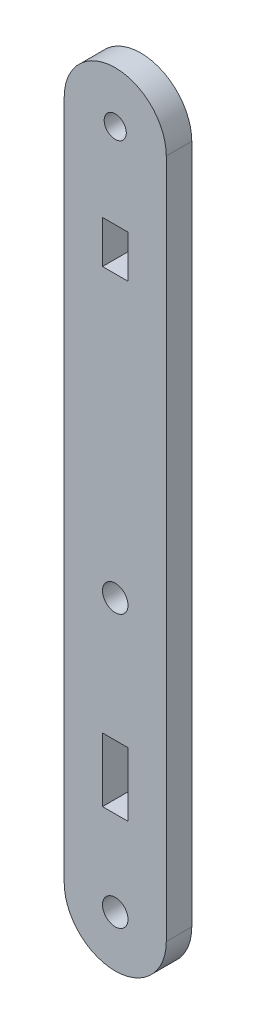
ISO-10303-21;
HEADER;
FILE_DESCRIPTION(('STEP AP214'),'2;1');
FILE_NAME('part.step','',(''),(''),'','','');
FILE_SCHEMA(('AUTOMOTIVE_DESIGN { 1 0 10303 214 1 1 1 1 }'));
ENDSEC;
DATA;
#1=APPLICATION_CONTEXT('core data for automotive mechanical design processes');
#2=APPLICATION_PROTOCOL_DEFINITION('international standard','automotive_design',2000,#1);
#3=PRODUCT_CONTEXT('',#1,'mechanical');
#4=PRODUCT('Part','Part','',(#3));
#5=PRODUCT_RELATED_PRODUCT_CATEGORY('part','',(#4));
#6=PRODUCT_DEFINITION_FORMATION('','',#4);
#7=PRODUCT_DEFINITION_CONTEXT('part definition',#1,'design');
#8=PRODUCT_DEFINITION('design','',#6,#7);
#9=PRODUCT_DEFINITION_SHAPE('','',#8);
#10=(LENGTH_UNIT() NAMED_UNIT(*) SI_UNIT(.MILLI.,.METRE.));
#11=(NAMED_UNIT(*) PLANE_ANGLE_UNIT() SI_UNIT($,.RADIAN.));
#12=(NAMED_UNIT(*) SI_UNIT($,.STERADIAN.) SOLID_ANGLE_UNIT());
#13=UNCERTAINTY_MEASURE_WITH_UNIT(LENGTH_MEASURE(1.E-05),#10,'distance_accuracy_value','');
#14=(GEOMETRIC_REPRESENTATION_CONTEXT(3) GLOBAL_UNCERTAINTY_ASSIGNED_CONTEXT((#13)) GLOBAL_UNIT_ASSIGNED_CONTEXT((#10,
#11,#12)) REPRESENTATION_CONTEXT('',''));
#15=CARTESIAN_POINT('',(0.,0.,0.));
#16=DIRECTION('',(0.,0.,1.));
#17=DIRECTION('',(1.,0.,0.));
#18=AXIS2_PLACEMENT_3D('',#15,#16,#17);
#19=CARTESIAN_POINT('',(42.3632,2.80600378878156,3.));
#20=DIRECTION('',(0.,0.,1.));
#21=DIRECTION('',(1.,0.,0.));
#22=AXIS2_PLACEMENT_3D('',#19,#20,#21);
#23=PLANE('',#22);
#24=CARTESIAN_POINT('',(42.3663580515541,2.81303551562959,3.));
#25=DIRECTION('',(0.,0.,1.));
#26=DIRECTION('',(1.,0.,0.));
#27=AXIS2_PLACEMENT_3D('',#24,#25,#26);
#28=CIRCLE('',#27,1.5);
#29=CARTESIAN_POINT('',(43.8663580515541,2.81303551562959,3.));
#30=VERTEX_POINT('',#29);
#31=EDGE_CURVE('E196',#30,#30,#28,.T.);
#32=ORIENTED_EDGE('',*,*,#31,.F.);
#33=EDGE_LOOP('',(#32));
#34=FACE_BOUND('',#33,.T.);
#35=CARTESIAN_POINT('',(42.3632,2.80600378878156,3.));
#36=DIRECTION('',(0.,0.,1.));
#37=DIRECTION('',(1.,0.,0.));
#38=AXIS2_PLACEMENT_3D('',#35,#36,#37);
#39=CIRCLE('',#38,6.00000000020829);
#40=CARTESIAN_POINT('',(36.3632000000001,2.80605378875133,3.));
#41=VERTEX_POINT('',#40);
#42=CARTESIAN_POINT('',(48.3632,2.80595378881178,3.));
#43=VERTEX_POINT('',#42);
#44=EDGE_CURVE('E208',#41,#43,#39,.T.);
#45=ORIENTED_EDGE('',*,*,#44,.T.);
#46=DIRECTION('',(0.,1.,0.));
#47=VECTOR('',#46,1.);
#48=CARTESIAN_POINT('',(48.3632,82.8060537888093,3.));
#49=LINE('',#48,#47);
#50=CARTESIAN_POINT('',(48.3632,82.8060537888093,3.));
#51=VERTEX_POINT('',#50);
#52=EDGE_CURVE('E211',#43,#51,#49,.T.);
#53=ORIENTED_EDGE('',*,*,#52,.T.);
#54=CARTESIAN_POINT('',(42.3631999999999,82.8060537888093,3.));
#55=DIRECTION('',(0.,0.,1.));
#56=DIRECTION('',(1.,0.,0.));
#57=AXIS2_PLACEMENT_3D('',#54,#55,#56);
#58=CIRCLE('',#57,6.);
#59=CARTESIAN_POINT('',(36.3632,82.8060537888093,3.));
#60=VERTEX_POINT('',#59);
#61=EDGE_CURVE('E214',#51,#60,#58,.T.);
#62=ORIENTED_EDGE('',*,*,#61,.T.);
#63=DIRECTION('',(0.,-1.,0.));
#64=VECTOR('',#63,1.);
#65=CARTESIAN_POINT('',(36.3632,82.8060537888093,3.));
#66=LINE('',#65,#64);
#67=EDGE_CURVE('E216',#60,#41,#66,.T.);
#68=ORIENTED_EDGE('',*,*,#67,.T.);
#69=EDGE_LOOP('',(#45,#53,#62,#68));
#70=FACE_BOUND('',#69,.T.);
#71=CARTESIAN_POINT('',(42.3632,34.8059537888087,3.));
#72=DIRECTION('',(0.,0.,1.));
#73=DIRECTION('',(1.,0.,0.));
#74=AXIS2_PLACEMENT_3D('',#71,#72,#73);
#75=CIRCLE('',#74,1.50000000000001);
#76=CARTESIAN_POINT('',(43.8632,34.8059537888087,3.));
#77=VERTEX_POINT('',#76);
#78=EDGE_CURVE('E202',#77,#77,#75,.T.);
#79=ORIENTED_EDGE('',*,*,#78,.F.);
#80=EDGE_LOOP('',(#79));
#81=FACE_BOUND('',#80,.T.);
#82=CARTESIAN_POINT('',(42.3631999999999,82.8060537888093,3.));
#83=DIRECTION('',(0.,0.,1.));
#84=DIRECTION('',(1.,0.,0.));
#85=AXIS2_PLACEMENT_3D('',#82,#83,#84);
#86=CIRCLE('',#85,1.29999999807684);
#87=CARTESIAN_POINT('',(43.6631999980768,82.8060537888093,3.));
#88=VERTEX_POINT('',#87);
#89=EDGE_CURVE('E190',#88,#88,#86,.T.);
#90=ORIENTED_EDGE('',*,*,#89,.F.);
#91=EDGE_LOOP('',(#90));
#92=FACE_BOUND('',#91,.T.);
#93=DIRECTION('',(-1.,0.,0.));
#94=VECTOR('',#93,1.);
#95=CARTESIAN_POINT('',(43.8632,72.8060537888094,3.));
#96=LINE('',#95,#94);
#97=CARTESIAN_POINT('',(43.8632,72.8060537888094,3.));
#98=VERTEX_POINT('',#97);
#99=CARTESIAN_POINT('',(40.8632,72.8060537888094,3.));
#100=VERTEX_POINT('',#99);
#101=EDGE_CURVE('E161',#98,#100,#96,.T.);
#102=ORIENTED_EDGE('',*,*,#101,.F.);
#103=DIRECTION('',(0.,1.,0.));
#104=VECTOR('',#103,1.);
#105=CARTESIAN_POINT('',(43.8632,67.8060537888094,3.));
#106=LINE('',#105,#104);
#107=CARTESIAN_POINT('',(43.8632,67.8060537888094,3.));
#108=VERTEX_POINT('',#107);
#109=EDGE_CURVE('E159',#108,#98,#106,.T.);
#110=ORIENTED_EDGE('',*,*,#109,.F.);
#111=DIRECTION('',(1.,0.,0.));
#112=VECTOR('',#111,1.);
#113=CARTESIAN_POINT('',(40.8632,67.8060537888094,3.));
#114=LINE('',#113,#112);
#115=CARTESIAN_POINT('',(40.8632,67.8060537888094,3.));
#116=VERTEX_POINT('',#115);
#117=EDGE_CURVE('E167',#116,#108,#114,.T.);
#118=ORIENTED_EDGE('',*,*,#117,.F.);
#119=DIRECTION('',(0.,-1.,0.));
#120=VECTOR('',#119,1.);
#121=CARTESIAN_POINT('',(40.8632,72.8060537888094,3.));
#122=LINE('',#121,#120);
#123=EDGE_CURVE('E164',#100,#116,#122,.T.);
#124=ORIENTED_EDGE('',*,*,#123,.F.);
#125=EDGE_LOOP('',(#102,#110,#118,#124));
#126=FACE_BOUND('',#125,.T.);
#127=DIRECTION('',(-1.,0.,0.));
#128=VECTOR('',#127,1.);
#129=CARTESIAN_POINT('',(43.8632,20.3060537888094,3.));
#130=LINE('',#129,#128);
#131=CARTESIAN_POINT('',(43.8632,20.3060537888094,3.));
#132=VERTEX_POINT('',#131);
#133=CARTESIAN_POINT('',(40.8632,20.3060537888094,3.));
#134=VERTEX_POINT('',#133);
#135=EDGE_CURVE('E131',#132,#134,#130,.T.);
#136=ORIENTED_EDGE('',*,*,#135,.F.);
#137=DIRECTION('',(0.,1.,0.));
#138=VECTOR('',#137,1.);
#139=CARTESIAN_POINT('',(43.8632,12.8060537888094,3.));
#140=LINE('',#139,#138);
#141=CARTESIAN_POINT('',(43.8632,12.8060537888094,3.));
#142=VERTEX_POINT('',#141);
#143=EDGE_CURVE('E123',#142,#132,#140,.T.);
#144=ORIENTED_EDGE('',*,*,#143,.F.);
#145=DIRECTION('',(1.,0.,0.));
#146=VECTOR('',#145,1.);
#147=CARTESIAN_POINT('',(40.8632,12.8060537888094,3.));
#148=LINE('',#147,#146);
#149=CARTESIAN_POINT('',(40.8632,12.8060537888094,3.));
#150=VERTEX_POINT('',#149);
#151=EDGE_CURVE('E145',#150,#142,#148,.T.);
#152=ORIENTED_EDGE('',*,*,#151,.F.);
#153=DIRECTION('',(0.,-1.,0.));
#154=VECTOR('',#153,1.);
#155=CARTESIAN_POINT('',(40.8632,20.3060537888094,3.));
#156=LINE('',#155,#154);
#157=EDGE_CURVE('E143',#134,#150,#156,.T.);
#158=ORIENTED_EDGE('',*,*,#157,.F.);
#159=EDGE_LOOP('',(#136,#144,#152,#158));
#160=FACE_BOUND('',#159,.T.);
#161=ADVANCED_FACE('F34',(#34,#70,#81,#92,#126,#160),#23,.T.);
#162=CARTESIAN_POINT('',(42.3632,2.80600378878156,0.));
#163=DIRECTION('',(0.,0.,1.));
#164=DIRECTION('',(1.,0.,0.));
#165=AXIS2_PLACEMENT_3D('',#162,#163,#164);
#166=PLANE('',#165);
#167=DIRECTION('',(0.,1.,0.));
#168=VECTOR('',#167,1.);
#169=CARTESIAN_POINT('',(43.8632,67.8060537888094,0.));
#170=LINE('',#169,#168);
#171=CARTESIAN_POINT('',(43.8632,67.8060537888094,0.));
#172=VERTEX_POINT('',#171);
#173=CARTESIAN_POINT('',(43.8632,72.8060537888094,0.));
#174=VERTEX_POINT('',#173);
#175=EDGE_CURVE('E139',#172,#174,#170,.T.);
#176=ORIENTED_EDGE('',*,*,#175,.T.);
#177=DIRECTION('',(-1.,0.,0.));
#178=VECTOR('',#177,1.);
#179=CARTESIAN_POINT('',(43.8632,72.8060537888094,0.));
#180=LINE('',#179,#178);
#181=CARTESIAN_POINT('',(40.8632,72.8060537888094,0.));
#182=VERTEX_POINT('',#181);
#183=EDGE_CURVE('E172',#174,#182,#180,.T.);
#184=ORIENTED_EDGE('',*,*,#183,.T.);
#185=DIRECTION('',(0.,-1.,0.));
#186=VECTOR('',#185,1.);
#187=CARTESIAN_POINT('',(40.8632,72.8060537888094,0.));
#188=LINE('',#187,#186);
#189=CARTESIAN_POINT('',(40.8632,67.8060537888094,0.));
#190=VERTEX_POINT('',#189);
#191=EDGE_CURVE('E175',#182,#190,#188,.T.);
#192=ORIENTED_EDGE('',*,*,#191,.T.);
#193=DIRECTION('',(1.,0.,0.));
#194=VECTOR('',#193,1.);
#195=CARTESIAN_POINT('',(40.8632,67.8060537888094,0.));
#196=LINE('',#195,#194);
#197=EDGE_CURVE('E162',#190,#172,#196,.T.);
#198=ORIENTED_EDGE('',*,*,#197,.T.);
#199=EDGE_LOOP('',(#176,#184,#192,#198));
#200=FACE_BOUND('',#199,.T.);
#201=CARTESIAN_POINT('',(42.3632,2.80600378878156,0.));
#202=DIRECTION('',(0.,0.,1.));
#203=DIRECTION('',(1.,0.,0.));
#204=AXIS2_PLACEMENT_3D('',#201,#202,#203);
#205=CIRCLE('',#204,6.00000000020829);
#206=CARTESIAN_POINT('',(36.3632000000001,2.80605378875133,0.));
#207=VERTEX_POINT('',#206);
#208=CARTESIAN_POINT('',(48.3632,2.80595378881178,0.));
#209=VERTEX_POINT('',#208);
#210=EDGE_CURVE('E205',#207,#209,#205,.T.);
#211=ORIENTED_EDGE('',*,*,#210,.F.);
#212=DIRECTION('',(0.,-1.,0.));
#213=VECTOR('',#212,1.);
#214=CARTESIAN_POINT('',(36.3632,82.8060537888093,0.));
#215=LINE('',#214,#213);
#216=CARTESIAN_POINT('',(36.3632,82.8060537888093,0.));
#217=VERTEX_POINT('',#216);
#218=EDGE_CURVE('E212',#217,#207,#215,.T.);
#219=ORIENTED_EDGE('',*,*,#218,.F.);
#220=CARTESIAN_POINT('',(42.3631999999999,82.8060537888093,0.));
#221=DIRECTION('',(0.,0.,1.));
#222=DIRECTION('',(1.,0.,0.));
#223=AXIS2_PLACEMENT_3D('',#220,#221,#222);
#224=CIRCLE('',#223,6.);
#225=CARTESIAN_POINT('',(48.3632,82.8060537888093,0.));
#226=VERTEX_POINT('',#225);
#227=EDGE_CURVE('E223',#226,#217,#224,.T.);
#228=ORIENTED_EDGE('',*,*,#227,.F.);
#229=DIRECTION('',(0.,1.,0.));
#230=VECTOR('',#229,1.);
#231=CARTESIAN_POINT('',(48.3632,82.8060537888093,0.));
#232=LINE('',#231,#230);
#233=EDGE_CURVE('E221',#209,#226,#232,.T.);
#234=ORIENTED_EDGE('',*,*,#233,.F.);
#235=EDGE_LOOP('',(#211,#219,#228,#234));
#236=FACE_BOUND('',#235,.T.);
#237=CARTESIAN_POINT('',(42.3632,34.8059537888087,0.));
#238=DIRECTION('',(0.,0.,1.));
#239=DIRECTION('',(1.,0.,0.));
#240=AXIS2_PLACEMENT_3D('',#237,#238,#239);
#241=CIRCLE('',#240,1.50000000000001);
#242=CARTESIAN_POINT('',(43.8632,34.8059537888087,0.));
#243=VERTEX_POINT('',#242);
#244=EDGE_CURVE('E199',#243,#243,#241,.T.);
#245=ORIENTED_EDGE('',*,*,#244,.T.);
#246=EDGE_LOOP('',(#245));
#247=FACE_BOUND('',#246,.T.);
#248=CARTESIAN_POINT('',(42.3663580515541,2.81303551562959,0.));
#249=DIRECTION('',(0.,0.,1.));
#250=DIRECTION('',(1.,0.,0.));
#251=AXIS2_PLACEMENT_3D('',#248,#249,#250);
#252=CIRCLE('',#251,1.5);
#253=CARTESIAN_POINT('',(43.8663580515541,2.81303551562959,0.));
#254=VERTEX_POINT('',#253);
#255=EDGE_CURVE('E193',#254,#254,#252,.T.);
#256=ORIENTED_EDGE('',*,*,#255,.T.);
#257=EDGE_LOOP('',(#256));
#258=FACE_BOUND('',#257,.T.);
#259=CARTESIAN_POINT('',(42.3631999999999,82.8060537888093,0.));
#260=DIRECTION('',(0.,0.,1.));
#261=DIRECTION('',(1.,0.,0.));
#262=AXIS2_PLACEMENT_3D('',#259,#260,#261);
#263=CIRCLE('',#262,1.29999999807684);
#264=CARTESIAN_POINT('',(43.6631999980768,82.8060537888093,0.));
#265=VERTEX_POINT('',#264);
#266=EDGE_CURVE('E189',#265,#265,#263,.T.);
#267=ORIENTED_EDGE('',*,*,#266,.T.);
#268=EDGE_LOOP('',(#267));
#269=FACE_BOUND('',#268,.T.);
#270=DIRECTION('',(0.,1.,0.));
#271=VECTOR('',#270,1.);
#272=CARTESIAN_POINT('',(43.8632,12.8060537888094,0.));
#273=LINE('',#272,#271);
#274=CARTESIAN_POINT('',(43.8632,12.8060537888094,0.));
#275=VERTEX_POINT('',#274);
#276=CARTESIAN_POINT('',(43.8632,20.3060537888094,0.));
#277=VERTEX_POINT('',#276);
#278=EDGE_CURVE('E57',#275,#277,#273,.T.);
#279=ORIENTED_EDGE('',*,*,#278,.T.);
#280=DIRECTION('',(-1.,0.,0.));
#281=VECTOR('',#280,1.);
#282=CARTESIAN_POINT('',(43.8632,20.3060537888094,0.));
#283=LINE('',#282,#281);
#284=CARTESIAN_POINT('',(40.8632,20.3060537888094,0.));
#285=VERTEX_POINT('',#284);
#286=EDGE_CURVE('E138',#277,#285,#283,.T.);
#287=ORIENTED_EDGE('',*,*,#286,.T.);
#288=DIRECTION('',(0.,-1.,0.));
#289=VECTOR('',#288,1.);
#290=CARTESIAN_POINT('',(40.8632,20.3060537888094,0.));
#291=LINE('',#290,#289);
#292=CARTESIAN_POINT('',(40.8632,12.8060537888094,0.));
#293=VERTEX_POINT('',#292);
#294=EDGE_CURVE('E151',#285,#293,#291,.T.);
#295=ORIENTED_EDGE('',*,*,#294,.T.);
#296=DIRECTION('',(1.,0.,0.));
#297=VECTOR('',#296,1.);
#298=CARTESIAN_POINT('',(40.8632,12.8060537888094,0.));
#299=LINE('',#298,#297);
#300=EDGE_CURVE('E132',#293,#275,#299,.T.);
#301=ORIENTED_EDGE('',*,*,#300,.T.);
#302=EDGE_LOOP('',(#279,#287,#295,#301));
#303=FACE_BOUND('',#302,.T.);
#304=ADVANCED_FACE('F241',(#200,#236,#247,#258,#269,#303),#166,.F.);
#305=CARTESIAN_POINT('',(42.3632,2.80600378878156,3.));
#306=DIRECTION('',(0.,0.,-1.));
#307=DIRECTION('',(-1.,0.,0.));
#308=AXIS2_PLACEMENT_3D('',#305,#306,#307);
#309=CYLINDRICAL_SURFACE('',#308,6.00000000020829);
#310=ORIENTED_EDGE('',*,*,#210,.T.);
#311=DIRECTION('',(0.,0.,-1.));
#312=VECTOR('',#311,1.);
#313=CARTESIAN_POINT('',(48.3632,2.80595378881178,3.));
#314=LINE('',#313,#312);
#315=EDGE_CURVE('E11',#43,#209,#314,.T.);
#316=ORIENTED_EDGE('',*,*,#315,.F.);
#317=ORIENTED_EDGE('',*,*,#44,.F.);
#318=DIRECTION('',(0.,0.,-1.));
#319=VECTOR('',#318,1.);
#320=CARTESIAN_POINT('',(36.3632000000001,2.80605378875133,3.));
#321=LINE('',#320,#319);
#322=EDGE_CURVE('E218',#41,#207,#321,.T.);
#323=ORIENTED_EDGE('',*,*,#322,.T.);
#324=EDGE_LOOP('',(#310,#316,#317,#323));
#325=FACE_BOUND('',#324,.T.);
#326=ADVANCED_FACE('F36',(#325),#309,.T.);
#327=CARTESIAN_POINT('',(48.3632,82.8060537888093,3.));
#328=DIRECTION('',(-1.,0.,0.));
#329=DIRECTION('',(0.,0.,1.));
#330=AXIS2_PLACEMENT_3D('',#327,#328,#329);
#331=PLANE('',#330);
#332=ORIENTED_EDGE('',*,*,#233,.T.);
#333=DIRECTION('',(0.,0.,-1.));
#334=VECTOR('',#333,1.);
#335=CARTESIAN_POINT('',(48.3632,82.8060537888093,3.));
#336=LINE('',#335,#334);
#337=EDGE_CURVE('E42',#51,#226,#336,.T.);
#338=ORIENTED_EDGE('',*,*,#337,.F.);
#339=ORIENTED_EDGE('',*,*,#52,.F.);
#340=ORIENTED_EDGE('',*,*,#315,.T.);
#341=EDGE_LOOP('',(#332,#338,#339,#340));
#342=FACE_BOUND('',#341,.T.);
#343=ADVANCED_FACE('F252',(#342),#331,.F.);
#344=CARTESIAN_POINT('',(42.3631999999999,82.8060537888093,3.));
#345=DIRECTION('',(0.,0.,-1.));
#346=DIRECTION('',(-1.,0.,0.));
#347=AXIS2_PLACEMENT_3D('',#344,#345,#346);
#348=CYLINDRICAL_SURFACE('',#347,6.);
#349=ORIENTED_EDGE('',*,*,#227,.T.);
#350=DIRECTION('',(0.,0.,-1.));
#351=VECTOR('',#350,1.);
#352=CARTESIAN_POINT('',(36.3632,82.8060537888093,3.));
#353=LINE('',#352,#351);
#354=EDGE_CURVE('E228',#60,#217,#353,.T.);
#355=ORIENTED_EDGE('',*,*,#354,.F.);
#356=ORIENTED_EDGE('',*,*,#61,.F.);
#357=ORIENTED_EDGE('',*,*,#337,.T.);
#358=EDGE_LOOP('',(#349,#355,#356,#357));
#359=FACE_BOUND('',#358,.T.);
#360=ADVANCED_FACE('F235',(#359),#348,.T.);
#361=CARTESIAN_POINT('',(36.3632,82.8060537888093,3.));
#362=DIRECTION('',(1.,0.,0.));
#363=DIRECTION('',(0.,1.,0.));
#364=AXIS2_PLACEMENT_3D('',#361,#362,#363);
#365=PLANE('',#364);
#366=ORIENTED_EDGE('',*,*,#218,.T.);
#367=ORIENTED_EDGE('',*,*,#322,.F.);
#368=ORIENTED_EDGE('',*,*,#67,.F.);
#369=ORIENTED_EDGE('',*,*,#354,.T.);
#370=EDGE_LOOP('',(#366,#367,#368,#369));
#371=FACE_BOUND('',#370,.T.);
#372=ADVANCED_FACE('F245',(#371),#365,.F.);
#373=CARTESIAN_POINT('',(42.3632,34.8059537888087,3.));
#374=DIRECTION('',(0.,0.,-1.));
#375=DIRECTION('',(-1.,0.,0.));
#376=AXIS2_PLACEMENT_3D('',#373,#374,#375);
#377=CYLINDRICAL_SURFACE('',#376,1.50000000000001);
#378=ORIENTED_EDGE('',*,*,#78,.T.);
#379=EDGE_LOOP('',(#378));
#380=FACE_BOUND('',#379,.T.);
#381=ORIENTED_EDGE('',*,*,#244,.F.);
#382=EDGE_LOOP('',(#381));
#383=FACE_BOUND('',#382,.T.);
#384=ADVANCED_FACE('F269',(#380,#383),#377,.F.);
#385=CARTESIAN_POINT('',(42.3663580515541,2.81303551562959,3.));
#386=DIRECTION('',(0.,0.,-1.));
#387=DIRECTION('',(-1.,0.,0.));
#388=AXIS2_PLACEMENT_3D('',#385,#386,#387);
#389=CYLINDRICAL_SURFACE('',#388,1.5);
#390=ORIENTED_EDGE('',*,*,#31,.T.);
#391=EDGE_LOOP('',(#390));
#392=FACE_BOUND('',#391,.T.);
#393=ORIENTED_EDGE('',*,*,#255,.F.);
#394=EDGE_LOOP('',(#393));
#395=FACE_BOUND('',#394,.T.);
#396=ADVANCED_FACE('F276',(#392,#395),#389,.F.);
#397=CARTESIAN_POINT('',(42.3631999999999,82.8060537888093,3.));
#398=DIRECTION('',(0.,0.,-1.));
#399=DIRECTION('',(-1.,0.,0.));
#400=AXIS2_PLACEMENT_3D('',#397,#398,#399);
#401=CYLINDRICAL_SURFACE('',#400,1.29999999807684);
#402=ORIENTED_EDGE('',*,*,#89,.T.);
#403=EDGE_LOOP('',(#402));
#404=FACE_BOUND('',#403,.T.);
#405=ORIENTED_EDGE('',*,*,#266,.F.);
#406=EDGE_LOOP('',(#405));
#407=FACE_BOUND('',#406,.T.);
#408=ADVANCED_FACE('F281',(#404,#407),#401,.F.);
#409=CARTESIAN_POINT('',(43.8632,67.8060537888094,3.));
#410=DIRECTION('',(-1.,0.,0.));
#411=DIRECTION('',(0.,0.,1.));
#412=AXIS2_PLACEMENT_3D('',#409,#410,#411);
#413=PLANE('',#412);
#414=ORIENTED_EDGE('',*,*,#175,.F.);
#415=DIRECTION('',(0.,0.,-1.));
#416=VECTOR('',#415,1.);
#417=CARTESIAN_POINT('',(43.8632,67.8060537888094,3.));
#418=LINE('',#417,#416);
#419=EDGE_CURVE('E169',#108,#172,#418,.T.);
#420=ORIENTED_EDGE('',*,*,#419,.F.);
#421=ORIENTED_EDGE('',*,*,#109,.T.);
#422=DIRECTION('',(0.,0.,-1.));
#423=VECTOR('',#422,1.);
#424=CARTESIAN_POINT('',(43.8632,72.8060537888094,3.));
#425=LINE('',#424,#423);
#426=EDGE_CURVE('E186',#98,#174,#425,.T.);
#427=ORIENTED_EDGE('',*,*,#426,.T.);
#428=EDGE_LOOP('',(#414,#420,#421,#427));
#429=FACE_BOUND('',#428,.T.);
#430=ADVANCED_FACE('F317',(#429),#413,.T.);
#431=CARTESIAN_POINT('',(43.8632,72.8060537888094,3.));
#432=DIRECTION('',(0.,-1.,0.));
#433=DIRECTION('',(1.,0.,0.));
#434=AXIS2_PLACEMENT_3D('',#431,#432,#433);
#435=PLANE('',#434);
#436=ORIENTED_EDGE('',*,*,#183,.F.);
#437=ORIENTED_EDGE('',*,*,#426,.F.);
#438=ORIENTED_EDGE('',*,*,#101,.T.);
#439=DIRECTION('',(0.,0.,-1.));
#440=VECTOR('',#439,1.);
#441=CARTESIAN_POINT('',(40.8632,72.8060537888094,3.));
#442=LINE('',#441,#440);
#443=EDGE_CURVE('E184',#100,#182,#442,.T.);
#444=ORIENTED_EDGE('',*,*,#443,.T.);
#445=EDGE_LOOP('',(#436,#437,#438,#444));
#446=FACE_BOUND('',#445,.T.);
#447=ADVANCED_FACE('F313',(#446),#435,.T.);
#448=CARTESIAN_POINT('',(40.8632,72.8060537888094,3.));
#449=DIRECTION('',(1.,0.,0.));
#450=DIRECTION('',(0.,0.,-1.));
#451=AXIS2_PLACEMENT_3D('',#448,#449,#450);
#452=PLANE('',#451);
#453=ORIENTED_EDGE('',*,*,#191,.F.);
#454=ORIENTED_EDGE('',*,*,#443,.F.);
#455=ORIENTED_EDGE('',*,*,#123,.T.);
#456=DIRECTION('',(0.,0.,-1.));
#457=VECTOR('',#456,1.);
#458=CARTESIAN_POINT('',(40.8632,67.8060537888094,3.));
#459=LINE('',#458,#457);
#460=EDGE_CURVE('E182',#116,#190,#459,.T.);
#461=ORIENTED_EDGE('',*,*,#460,.T.);
#462=EDGE_LOOP('',(#453,#454,#455,#461));
#463=FACE_BOUND('',#462,.T.);
#464=ADVANCED_FACE('F309',(#463),#452,.T.);
#465=CARTESIAN_POINT('',(40.8632,67.8060537888094,3.));
#466=DIRECTION('',(0.,1.,0.));
#467=DIRECTION('',(-1.,0.,0.));
#468=AXIS2_PLACEMENT_3D('',#465,#466,#467);
#469=PLANE('',#468);
#470=ORIENTED_EDGE('',*,*,#197,.F.);
#471=ORIENTED_EDGE('',*,*,#460,.F.);
#472=ORIENTED_EDGE('',*,*,#117,.T.);
#473=ORIENTED_EDGE('',*,*,#419,.T.);
#474=EDGE_LOOP('',(#470,#471,#472,#473));
#475=FACE_BOUND('',#474,.T.);
#476=ADVANCED_FACE('F306',(#475),#469,.T.);
#477=CARTESIAN_POINT('',(43.8632,12.8060537888094,3.));
#478=DIRECTION('',(-1.,0.,0.));
#479=DIRECTION('',(0.,0.,1.));
#480=AXIS2_PLACEMENT_3D('',#477,#478,#479);
#481=PLANE('',#480);
#482=ORIENTED_EDGE('',*,*,#278,.F.);
#483=DIRECTION('',(0.,0.,-1.));
#484=VECTOR('',#483,1.);
#485=CARTESIAN_POINT('',(43.8632,12.8060537888094,3.));
#486=LINE('',#485,#484);
#487=EDGE_CURVE('E127',#142,#275,#486,.T.);
#488=ORIENTED_EDGE('',*,*,#487,.F.);
#489=ORIENTED_EDGE('',*,*,#143,.T.);
#490=DIRECTION('',(0.,0.,-1.));
#491=VECTOR('',#490,1.);
#492=CARTESIAN_POINT('',(43.8632,20.3060537888094,3.));
#493=LINE('',#492,#491);
#494=EDGE_CURVE('E126',#132,#277,#493,.T.);
#495=ORIENTED_EDGE('',*,*,#494,.T.);
#496=EDGE_LOOP('',(#482,#488,#489,#495));
#497=FACE_BOUND('',#496,.T.);
#498=ADVANCED_FACE('F125',(#497),#481,.T.);
#499=CARTESIAN_POINT('',(43.8632,20.3060537888094,3.));
#500=DIRECTION('',(0.,-1.,0.));
#501=DIRECTION('',(0.,0.,-1.));
#502=AXIS2_PLACEMENT_3D('',#499,#500,#501);
#503=PLANE('',#502);
#504=ORIENTED_EDGE('',*,*,#286,.F.);
#505=ORIENTED_EDGE('',*,*,#494,.F.);
#506=ORIENTED_EDGE('',*,*,#135,.T.);
#507=DIRECTION('',(0.,0.,-1.));
#508=VECTOR('',#507,1.);
#509=CARTESIAN_POINT('',(40.8632,20.3060537888094,3.));
#510=LINE('',#509,#508);
#511=EDGE_CURVE('E140',#134,#285,#510,.T.);
#512=ORIENTED_EDGE('',*,*,#511,.T.);
#513=EDGE_LOOP('',(#504,#505,#506,#512));
#514=FACE_BOUND('',#513,.T.);
#515=ADVANCED_FACE('F135',(#514),#503,.T.);
#516=CARTESIAN_POINT('',(40.8632,20.3060537888094,3.));
#517=DIRECTION('',(1.,0.,0.));
#518=DIRECTION('',(0.,0.,-1.));
#519=AXIS2_PLACEMENT_3D('',#516,#517,#518);
#520=PLANE('',#519);
#521=ORIENTED_EDGE('',*,*,#294,.F.);
#522=ORIENTED_EDGE('',*,*,#511,.F.);
#523=ORIENTED_EDGE('',*,*,#157,.T.);
#524=DIRECTION('',(0.,0.,-1.));
#525=VECTOR('',#524,1.);
#526=CARTESIAN_POINT('',(40.8632,12.8060537888094,3.));
#527=LINE('',#526,#525);
#528=EDGE_CURVE('E49',#150,#293,#527,.T.);
#529=ORIENTED_EDGE('',*,*,#528,.T.);
#530=EDGE_LOOP('',(#521,#522,#523,#529));
#531=FACE_BOUND('',#530,.T.);
#532=ADVANCED_FACE('F294',(#531),#520,.T.);
#533=CARTESIAN_POINT('',(40.8632,12.8060537888094,3.));
#534=DIRECTION('',(0.,1.,0.));
#535=DIRECTION('',(-1.,0.,0.));
#536=AXIS2_PLACEMENT_3D('',#533,#534,#535);
#537=PLANE('',#536);
#538=ORIENTED_EDGE('',*,*,#300,.F.);
#539=ORIENTED_EDGE('',*,*,#528,.F.);
#540=ORIENTED_EDGE('',*,*,#151,.T.);
#541=ORIENTED_EDGE('',*,*,#487,.T.);
#542=EDGE_LOOP('',(#538,#539,#540,#541));
#543=FACE_BOUND('',#542,.T.);
#544=ADVANCED_FACE('F292',(#543),#537,.T.);
#545=CLOSED_SHELL('',(#161,#304,#326,#343,#360,#372,#384,#396,#408,#430,#447,#464,#476,#498,
#515,#532,#544));
#546=MANIFOLD_SOLID_BREP('B2',#545);
#547=ADVANCED_BREP_SHAPE_REPRESENTATION('',(#18,#546),#14);
#548=SHAPE_DEFINITION_REPRESENTATION(#9,#547);
ENDSEC;
END-ISO-10303-21;
